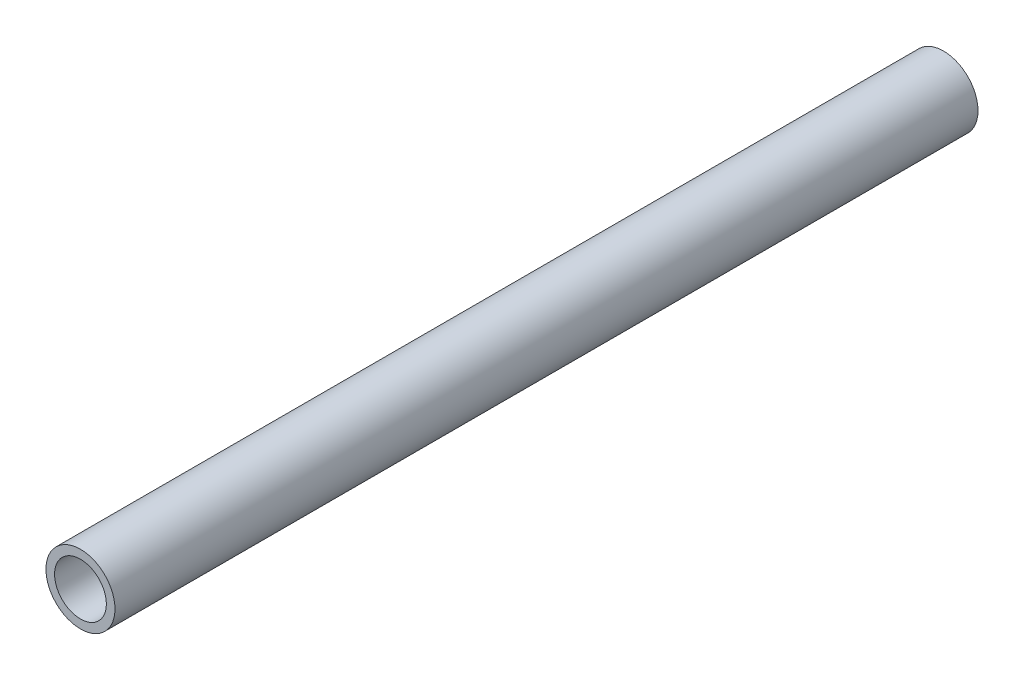
ISO-10303-21;
HEADER;
FILE_DESCRIPTION(('STEP AP214'),'2;1');
FILE_NAME('part.step','',(''),(''),'','','');
FILE_SCHEMA(('AUTOMOTIVE_DESIGN { 1 0 10303 214 1 1 1 1 }'));
ENDSEC;
DATA;
#1=APPLICATION_CONTEXT('core data for automotive mechanical design processes');
#2=APPLICATION_PROTOCOL_DEFINITION('international standard','automotive_design',2000,#1);
#3=PRODUCT_CONTEXT('',#1,'mechanical');
#4=PRODUCT('Part','Part','',(#3));
#5=PRODUCT_RELATED_PRODUCT_CATEGORY('part','',(#4));
#6=PRODUCT_DEFINITION_FORMATION('','',#4);
#7=PRODUCT_DEFINITION_CONTEXT('part definition',#1,'design');
#8=PRODUCT_DEFINITION('design','',#6,#7);
#9=PRODUCT_DEFINITION_SHAPE('','',#8);
#10=(LENGTH_UNIT() NAMED_UNIT(*) SI_UNIT(.MILLI.,.METRE.));
#11=(NAMED_UNIT(*) PLANE_ANGLE_UNIT() SI_UNIT($,.RADIAN.));
#12=(NAMED_UNIT(*) SI_UNIT($,.STERADIAN.) SOLID_ANGLE_UNIT());
#13=UNCERTAINTY_MEASURE_WITH_UNIT(LENGTH_MEASURE(1.E-05),#10,'distance_accuracy_value','');
#14=(GEOMETRIC_REPRESENTATION_CONTEXT(3) GLOBAL_UNCERTAINTY_ASSIGNED_CONTEXT((#13)) GLOBAL_UNIT_ASSIGNED_CONTEXT((#10,
#11,#12)) REPRESENTATION_CONTEXT('',''));
#15=CARTESIAN_POINT('',(0.,0.,0.));
#16=DIRECTION('',(0.,0.,1.));
#17=DIRECTION('',(1.,0.,0.));
#18=AXIS2_PLACEMENT_3D('',#15,#16,#17);
#19=CARTESIAN_POINT('',(0.,0.,50.));
#20=DIRECTION('',(0.,0.,1.));
#21=DIRECTION('',(1.,0.,0.));
#22=AXIS2_PLACEMENT_3D('',#19,#20,#21);
#23=PLANE('',#22);
#24=CARTESIAN_POINT('',(0.,0.,50.));
#25=DIRECTION('',(0.,0.,1.));
#26=DIRECTION('',(1.,0.,0.));
#27=AXIS2_PLACEMENT_3D('',#24,#25,#26);
#28=CIRCLE('',#27,4.);
#29=CARTESIAN_POINT('',(4.,0.,50.));
#30=VERTEX_POINT('',#29);
#31=EDGE_CURVE('E10',#30,#30,#28,.T.);
#32=ORIENTED_EDGE('',*,*,#31,.T.);
#33=EDGE_LOOP('',(#32));
#34=FACE_BOUND('',#33,.T.);
#35=CARTESIAN_POINT('',(0.,0.,50.));
#36=DIRECTION('',(0.,0.,1.));
#37=DIRECTION('',(1.,0.,0.));
#38=AXIS2_PLACEMENT_3D('',#35,#36,#37);
#39=CIRCLE('',#38,3.);
#40=CARTESIAN_POINT('',(3.,0.,50.));
#41=VERTEX_POINT('',#40);
#42=EDGE_CURVE('E50',#41,#41,#39,.T.);
#43=ORIENTED_EDGE('',*,*,#42,.F.);
#44=EDGE_LOOP('',(#43));
#45=FACE_BOUND('',#44,.T.);
#46=ADVANCED_FACE('F37',(#34,#45),#23,.T.);
#47=CARTESIAN_POINT('',(0.,0.,-50.));
#48=DIRECTION('',(0.,0.,1.));
#49=DIRECTION('',(1.,0.,0.));
#50=AXIS2_PLACEMENT_3D('',#47,#48,#49);
#51=PLANE('',#50);
#52=CARTESIAN_POINT('',(0.,0.,-50.));
#53=DIRECTION('',(0.,0.,1.));
#54=DIRECTION('',(1.,0.,0.));
#55=AXIS2_PLACEMENT_3D('',#52,#53,#54);
#56=CIRCLE('',#55,4.);
#57=CARTESIAN_POINT('',(4.,0.,-50.));
#58=VERTEX_POINT('',#57);
#59=EDGE_CURVE('E41',#58,#58,#56,.T.);
#60=ORIENTED_EDGE('',*,*,#59,.F.);
#61=EDGE_LOOP('',(#60));
#62=FACE_BOUND('',#61,.T.);
#63=CARTESIAN_POINT('',(0.,0.,-50.));
#64=DIRECTION('',(0.,0.,1.));
#65=DIRECTION('',(1.,0.,0.));
#66=AXIS2_PLACEMENT_3D('',#63,#64,#65);
#67=CIRCLE('',#66,3.);
#68=CARTESIAN_POINT('',(3.,0.,-50.));
#69=VERTEX_POINT('',#68);
#70=EDGE_CURVE('E52',#69,#69,#67,.T.);
#71=ORIENTED_EDGE('',*,*,#70,.T.);
#72=EDGE_LOOP('',(#71));
#73=FACE_BOUND('',#72,.T.);
#74=ADVANCED_FACE('F64',(#62,#73),#51,.F.);
#75=CARTESIAN_POINT('',(0.,0.,50.));
#76=DIRECTION('',(0.,0.,-1.));
#77=DIRECTION('',(-1.,0.,0.));
#78=AXIS2_PLACEMENT_3D('',#75,#76,#77);
#79=CYLINDRICAL_SURFACE('',#78,4.);
#80=ORIENTED_EDGE('',*,*,#31,.F.);
#81=EDGE_LOOP('',(#80));
#82=FACE_BOUND('',#81,.T.);
#83=ORIENTED_EDGE('',*,*,#59,.T.);
#84=EDGE_LOOP('',(#83));
#85=FACE_BOUND('',#84,.T.);
#86=ADVANCED_FACE('F39',(#82,#85),#79,.T.);
#87=CARTESIAN_POINT('',(0.,0.,50.));
#88=DIRECTION('',(0.,0.,-1.));
#89=DIRECTION('',(-1.,0.,0.));
#90=AXIS2_PLACEMENT_3D('',#87,#88,#89);
#91=CYLINDRICAL_SURFACE('',#90,3.);
#92=ORIENTED_EDGE('',*,*,#42,.T.);
#93=EDGE_LOOP('',(#92));
#94=FACE_BOUND('',#93,.T.);
#95=ORIENTED_EDGE('',*,*,#70,.F.);
#96=EDGE_LOOP('',(#95));
#97=FACE_BOUND('',#96,.T.);
#98=ADVANCED_FACE('F60',(#94,#97),#91,.F.);
#99=CLOSED_SHELL('',(#46,#74,#86,#98));
#100=MANIFOLD_SOLID_BREP('B2',#99);
#101=ADVANCED_BREP_SHAPE_REPRESENTATION('',(#18,#100),#14);
#102=SHAPE_DEFINITION_REPRESENTATION(#9,#101);
ENDSEC;
END-ISO-10303-21;
